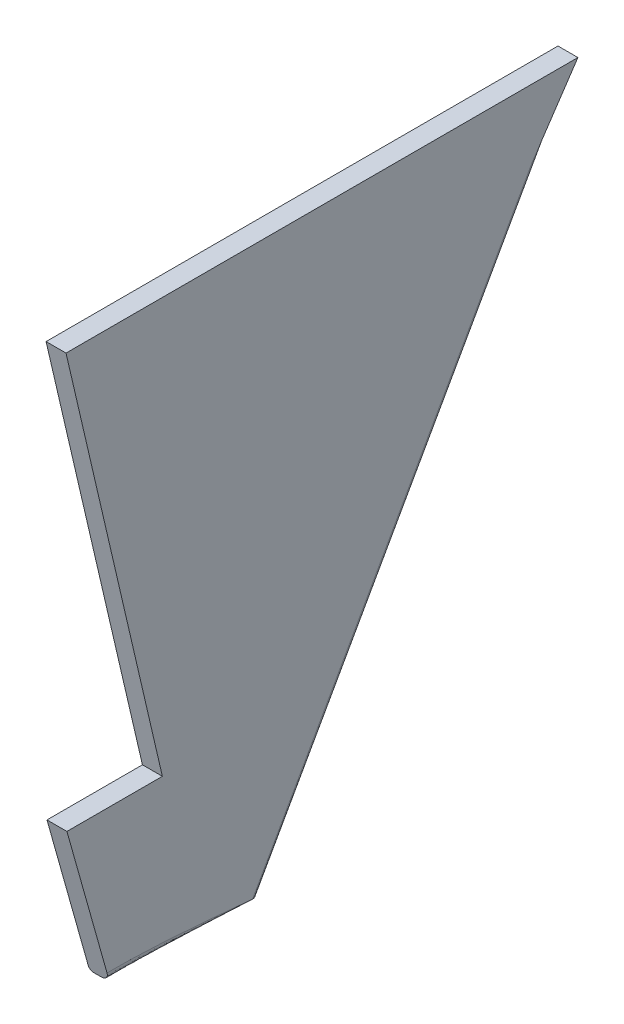
ISO-10303-21;
HEADER;
FILE_DESCRIPTION(('STEP AP214'),'2;1');
FILE_NAME('part.step','',(''),(''),'','','');
FILE_SCHEMA(('AUTOMOTIVE_DESIGN { 1 0 10303 214 1 1 1 1 }'));
ENDSEC;
DATA;
#1=APPLICATION_CONTEXT('core data for automotive mechanical design processes');
#2=APPLICATION_PROTOCOL_DEFINITION('international standard','automotive_design',2000,#1);
#3=PRODUCT_CONTEXT('',#1,'mechanical');
#4=PRODUCT('Part','Part','',(#3));
#5=PRODUCT_RELATED_PRODUCT_CATEGORY('part','',(#4));
#6=PRODUCT_DEFINITION_FORMATION('','',#4);
#7=PRODUCT_DEFINITION_CONTEXT('part definition',#1,'design');
#8=PRODUCT_DEFINITION('design','',#6,#7);
#9=PRODUCT_DEFINITION_SHAPE('','',#8);
#10=(LENGTH_UNIT() NAMED_UNIT(*) SI_UNIT(.MILLI.,.METRE.));
#11=(NAMED_UNIT(*) PLANE_ANGLE_UNIT() SI_UNIT($,.RADIAN.));
#12=(NAMED_UNIT(*) SI_UNIT($,.STERADIAN.) SOLID_ANGLE_UNIT());
#13=UNCERTAINTY_MEASURE_WITH_UNIT(LENGTH_MEASURE(1.E-05),#10,'distance_accuracy_value','');
#14=(GEOMETRIC_REPRESENTATION_CONTEXT(3) GLOBAL_UNCERTAINTY_ASSIGNED_CONTEXT((#13)) GLOBAL_UNIT_ASSIGNED_CONTEXT((#10,
#11,#12)) REPRESENTATION_CONTEXT('',''));
#15=CARTESIAN_POINT('',(0.,0.,0.));
#16=DIRECTION('',(0.,0.,1.));
#17=DIRECTION('',(1.,0.,0.));
#18=AXIS2_PLACEMENT_3D('',#15,#16,#17);
#19=CARTESIAN_POINT('',(11.43,199.641932542083,652.794975578985));
#20=DIRECTION('',(0.,0.48936367979796,0.872079806493993));
#21=DIRECTION('',(0.,-0.872079806493993,0.48936367979796));
#22=AXIS2_PLACEMENT_3D('',#19,#20,#21);
#23=PLANE('',#22);
#24=DIRECTION('',(-1.,0.,0.));
#25=VECTOR('',#24,1.);
#26=CARTESIAN_POINT('',(11.43,511.176192984029,477.978919826114));
#27=LINE('',#26,#25);
#28=CARTESIAN_POINT('',(8.89,511.176192984029,477.978919826114));
#29=VERTEX_POINT('',#28);
#30=CARTESIAN_POINT('',(0.,511.176192984029,477.978919826114));
#31=VERTEX_POINT('',#30);
#32=EDGE_CURVE('E132',#29,#31,#27,.T.);
#33=ORIENTED_EDGE('',*,*,#32,.F.);
#34=DIRECTION('',(0.,0.872079806493993,-0.48936367979796));
#35=VECTOR('',#34,1.);
#36=CARTESIAN_POINT('',(8.89,199.641932542083,652.794975578985));
#37=LINE('',#36,#35);
#38=CARTESIAN_POINT('',(8.89,199.641932542083,652.794975578985));
#39=VERTEX_POINT('',#38);
#40=EDGE_CURVE('E173',#29,#39,#37,.F.);
#41=ORIENTED_EDGE('',*,*,#40,.T.);
#42=DIRECTION('',(-1.,0.,0.));
#43=VECTOR('',#42,1.);
#44=CARTESIAN_POINT('',(11.43,199.641932542083,652.794975578985));
#45=LINE('',#44,#43);
#46=CARTESIAN_POINT('',(0.,199.641932542083,652.794975578985));
#47=VERTEX_POINT('',#46);
#48=EDGE_CURVE('E146',#39,#47,#45,.T.);
#49=ORIENTED_EDGE('',*,*,#48,.T.);
#50=DIRECTION('',(0.,0.872079806493993,-0.48936367979796));
#51=VECTOR('',#50,1.);
#52=CARTESIAN_POINT('',(0.,199.641932542083,652.794975578985));
#53=LINE('',#52,#51);
#54=EDGE_CURVE('E147',#47,#31,#53,.T.);
#55=ORIENTED_EDGE('',*,*,#54,.T.);
#56=EDGE_LOOP('',(#33,#41,#49,#55));
#57=FACE_BOUND('',#56,.T.);
#58=ADVANCED_FACE('F35',(#57),#23,.F.);
#59=CARTESIAN_POINT('',(11.43,524.187996290353,469.211556411961));
#60=DIRECTION('',(0.,0.558789444969546,0.829309565958712));
#61=DIRECTION('',(0.,-0.829309565958712,0.558789444969546));
#62=AXIS2_PLACEMENT_3D('',#59,#60,#61);
#63=PLANE('',#62);
#64=DIRECTION('',(0.,0.829309565958712,-0.558789444969546));
#65=VECTOR('',#64,1.);
#66=CARTESIAN_POINT('',(0.,524.187996290353,469.211556411961));
#67=LINE('',#66,#65);
#68=CARTESIAN_POINT('',(0.,524.187996290353,469.211556411961));
#69=VERTEX_POINT('',#68);
#70=EDGE_CURVE('E129',#31,#69,#67,.T.);
#71=ORIENTED_EDGE('',*,*,#70,.T.);
#72=DIRECTION('',(-1.,0.,0.));
#73=VECTOR('',#72,1.);
#74=CARTESIAN_POINT('',(11.43,524.187996290353,469.211556411961));
#75=LINE('',#74,#73);
#76=CARTESIAN_POINT('',(11.43,524.187996290353,469.211556411961));
#77=VERTEX_POINT('',#76);
#78=EDGE_CURVE('E126',#77,#69,#75,.T.);
#79=ORIENTED_EDGE('',*,*,#78,.F.);
#80=DIRECTION('',(0.,0.829309565958712,-0.558789444969546));
#81=VECTOR('',#80,1.);
#82=CARTESIAN_POINT('',(11.43,524.187996290353,469.211556411961));
#83=LINE('',#82,#81);
#84=CARTESIAN_POINT('',(11.43,485.322298720764,495.399294338459));
#85=VERTEX_POINT('',#84);
#86=EDGE_CURVE('E113',#85,#77,#83,.T.);
#87=ORIENTED_EDGE('',*,*,#86,.F.);
#88=CARTESIAN_POINT('',(8.89,485.322298720764,495.399294338459));
#89=DIRECTION('',(0.,0.558789444969546,0.829309565958712));
#90=DIRECTION('',(0.,0.829309565958712,-0.558789444969546));
#91=AXIS2_PLACEMENT_3D('',#88,#89,#90);
#92=ELLIPSE('',#91,31.1752032347239,2.54);
#93=EDGE_CURVE('E178',#85,#29,#92,.T.);
#94=ORIENTED_EDGE('',*,*,#93,.T.);
#95=ORIENTED_EDGE('',*,*,#32,.T.);
#96=EDGE_LOOP('',(#71,#79,#87,#94,#95));
#97=FACE_BOUND('',#96,.T.);
#98=ADVANCED_FACE('F127',(#97),#63,.F.);
#99=CARTESIAN_POINT('',(11.43,524.187996290353,762.632908821936));
#100=DIRECTION('',(0.,-1.,0.));
#101=DIRECTION('',(0.,0.,-1.));
#102=AXIS2_PLACEMENT_3D('',#99,#100,#101);
#103=PLANE('',#102);
#104=DIRECTION('',(0.,0.,1.));
#105=VECTOR('',#104,1.);
#106=CARTESIAN_POINT('',(0.,524.187996290353,762.632908821936));
#107=LINE('',#106,#105);
#108=CARTESIAN_POINT('',(0.,524.187996290353,762.632908821936));
#109=VERTEX_POINT('',#108);
#110=EDGE_CURVE('E151',#69,#109,#107,.T.);
#111=ORIENTED_EDGE('',*,*,#110,.T.);
#112=DIRECTION('',(-1.,0.,0.));
#113=VECTOR('',#112,1.);
#114=CARTESIAN_POINT('',(11.43,524.187996290353,762.632908821936));
#115=LINE('',#114,#113);
#116=CARTESIAN_POINT('',(11.43,524.187996290353,762.632908821936));
#117=VERTEX_POINT('',#116);
#118=EDGE_CURVE('E133',#117,#109,#115,.T.);
#119=ORIENTED_EDGE('',*,*,#118,.F.);
#120=DIRECTION('',(0.,0.,1.));
#121=VECTOR('',#120,1.);
#122=CARTESIAN_POINT('',(11.43,524.187996290353,762.632908821936));
#123=LINE('',#122,#121);
#124=EDGE_CURVE('E117',#77,#117,#123,.T.);
#125=ORIENTED_EDGE('',*,*,#124,.F.);
#126=ORIENTED_EDGE('',*,*,#78,.T.);
#127=EDGE_LOOP('',(#111,#119,#125,#126));
#128=FACE_BOUND('',#127,.T.);
#129=ADVANCED_FACE('F135',(#128),#103,.F.);
#130=CARTESIAN_POINT('',(11.43,286.46929318948,707.407516880236));
#131=DIRECTION('',(0.,0.226287918956308,-0.974060458972863));
#132=DIRECTION('',(0.,0.974060458972863,0.226287918956308));
#133=AXIS2_PLACEMENT_3D('',#130,#131,#132);
#134=PLANE('',#133);
#135=DIRECTION('',(0.,-0.974060458972862,-0.226287918956308));
#136=VECTOR('',#135,1.);
#137=CARTESIAN_POINT('',(0.,286.46929318948,707.407516880236));
#138=LINE('',#137,#136);
#139=CARTESIAN_POINT('',(0.,286.46929318948,707.407516880236));
#140=VERTEX_POINT('',#139);
#141=EDGE_CURVE('E153',#109,#140,#138,.T.);
#142=ORIENTED_EDGE('',*,*,#141,.T.);
#143=DIRECTION('',(-1.,0.,0.));
#144=VECTOR('',#143,1.);
#145=CARTESIAN_POINT('',(11.43,286.46929318948,707.407516880236));
#146=LINE('',#145,#144);
#147=CARTESIAN_POINT('',(11.43,286.46929318948,707.407516880236));
#148=VERTEX_POINT('',#147);
#149=EDGE_CURVE('E167',#148,#140,#146,.T.);
#150=ORIENTED_EDGE('',*,*,#149,.F.);
#151=DIRECTION('',(0.,-0.974060458972862,-0.226287918956308));
#152=VECTOR('',#151,1.);
#153=CARTESIAN_POINT('',(11.43,286.46929318948,707.407516880236));
#154=LINE('',#153,#152);
#155=EDGE_CURVE('E138',#117,#148,#154,.T.);
#156=ORIENTED_EDGE('',*,*,#155,.F.);
#157=ORIENTED_EDGE('',*,*,#118,.T.);
#158=EDGE_LOOP('',(#142,#150,#156,#157));
#159=FACE_BOUND('',#158,.T.);
#160=ADVANCED_FACE('F221',(#159),#134,.F.);
#161=CARTESIAN_POINT('',(11.43,286.46929318948,762.117456695006));
#162=DIRECTION('',(0.,-1.,0.));
#163=DIRECTION('',(0.,0.,-1.));
#164=AXIS2_PLACEMENT_3D('',#161,#162,#163);
#165=PLANE('',#164);
#166=DIRECTION('',(0.,0.,1.));
#167=VECTOR('',#166,1.);
#168=CARTESIAN_POINT('',(0.,286.46929318948,762.117456695006));
#169=LINE('',#168,#167);
#170=CARTESIAN_POINT('',(0.,286.46929318948,762.117456695006));
#171=VERTEX_POINT('',#170);
#172=EDGE_CURVE('E155',#140,#171,#169,.T.);
#173=ORIENTED_EDGE('',*,*,#172,.T.);
#174=DIRECTION('',(-1.,0.,0.));
#175=VECTOR('',#174,1.);
#176=CARTESIAN_POINT('',(11.43,286.46929318948,762.117456695006));
#177=LINE('',#176,#175);
#178=CARTESIAN_POINT('',(11.43,286.46929318948,762.117456695006));
#179=VERTEX_POINT('',#178);
#180=EDGE_CURVE('E164',#179,#171,#177,.T.);
#181=ORIENTED_EDGE('',*,*,#180,.F.);
#182=DIRECTION('',(0.,0.,1.));
#183=VECTOR('',#182,1.);
#184=CARTESIAN_POINT('',(11.43,286.46929318948,762.117456695006));
#185=LINE('',#184,#183);
#186=EDGE_CURVE('E140',#148,#179,#185,.T.);
#187=ORIENTED_EDGE('',*,*,#186,.F.);
#188=ORIENTED_EDGE('',*,*,#149,.T.);
#189=EDGE_LOOP('',(#173,#181,#187,#188));
#190=FACE_BOUND('',#189,.T.);
#191=ADVANCED_FACE('F216',(#190),#165,.F.);
#192=CARTESIAN_POINT('',(11.43,232.379623890235,746.905427948856));
#193=DIRECTION('',(0.,0.270734184612174,-0.96265414416725));
#194=DIRECTION('',(0.,0.96265414416725,0.270734184612174));
#195=AXIS2_PLACEMENT_3D('',#192,#193,#194);
#196=PLANE('',#195);
#197=DIRECTION('',(0.,-0.962654144167251,-0.270734184612174));
#198=VECTOR('',#197,1.);
#199=CARTESIAN_POINT('',(0.,232.379623890235,746.905427948856));
#200=LINE('',#199,#198);
#201=CARTESIAN_POINT('',(0.,202.181932542083,738.412712892417));
#202=VERTEX_POINT('',#201);
#203=EDGE_CURVE('E123',#171,#202,#200,.T.);
#204=ORIENTED_EDGE('',*,*,#203,.T.);
#205=CARTESIAN_POINT('',(0.,202.181932542083,738.412712892417));
#206=CARTESIAN_POINT('',(-3.71423070567647E-05,202.060029204381,738.378429135437));
#207=CARTESIAN_POINT('',(0.00877578466586887,201.938158327907,738.344154507764));
#208=CARTESIAN_POINT('',(0.043820666096106,201.696588485174,738.276216074427));
#209=CARTESIAN_POINT('',(0.070076692611092,201.576892755537,738.242553179024));
#210=CARTESIAN_POINT('',(0.147116432041593,201.317216131818,738.169522444766));
#211=CARTESIAN_POINT('',(0.201923267217242,201.178321912361,738.130460219272));
#212=CARTESIAN_POINT('',(0.335424452017582,200.911623591818,738.055454722451));
#213=CARTESIAN_POINT('',(0.414117460006704,200.783818868376,738.019511276095));
#214=CARTESIAN_POINT('',(0.591738151979026,200.545617825331,737.95252027465));
#215=CARTESIAN_POINT('',(0.690254214640734,200.434937557279,737.921392862687));
#216=CARTESIAN_POINT('',(0.905841754247257,200.231791783485,737.864260708051));
#217=CARTESIAN_POINT('',(1.02291101226961,200.139324102518,737.838255353624));
#218=CARTESIAN_POINT('',(1.26783850658103,199.978777362665,737.793103633279));
#219=CARTESIAN_POINT('',(1.39516894535962,199.90995160825,737.773747268779));
#220=CARTESIAN_POINT('',(1.66032111187818,199.7947548026,737.741349638294));
#221=CARTESIAN_POINT('',(1.79813481157029,199.748366765033,737.72830359512));
#222=CARTESIAN_POINT('',(2.03719877108296,199.690142938727,737.71192888751));
#223=CARTESIAN_POINT('',(2.13686370018449,199.672095082155,737.706853158327));
#224=CARTESIAN_POINT('',(2.33766838252238,199.647980894492,737.700071350993));
#225=CARTESIAN_POINT('',(2.43880698021651,199.641905636269,737.698362762202));
#226=CARTESIAN_POINT('',(2.54,199.641932542083,737.698370329118));
#227=B_SPLINE_CURVE_WITH_KNOTS('',3,(#205,#206,#207,#208,#209,#210,#211,#212,#213,#214,#215,
#216,#217,#218,#219,#220,#221,#222,#223,#224,#225,#226),.UNSPECIFIED.,.F.,.F.,(4,2,2,2,2,2,2,2,
2,2,4),(0.,0.379526777651838,0.759578405906741,1.22029475564002,1.68098523270193,
2.13294730481857,2.58485536397386,3.02078575347061,3.45638560608309,3.75989194789427,
4.06317190046572),.UNSPECIFIED.);
#228=CARTESIAN_POINT('',(2.54,199.641932542083,737.698370329118));
#229=VERTEX_POINT('',#228);
#230=EDGE_CURVE('E49',#202,#229,#227,.T.);
#231=ORIENTED_EDGE('',*,*,#230,.T.);
#232=DIRECTION('',(-1.,0.,0.));
#233=VECTOR('',#232,1.);
#234=CARTESIAN_POINT('',(11.43,199.641932542083,737.698370329118));
#235=LINE('',#234,#233);
#236=CARTESIAN_POINT('',(6.35,199.641932542083,737.698370329118));
#237=VERTEX_POINT('',#236);
#238=EDGE_CURVE('E161',#237,#229,#235,.T.);
#239=ORIENTED_EDGE('',*,*,#238,.F.);
#240=CARTESIAN_POINT('',(6.35,199.641932542083,737.698370329118));
#241=CARTESIAN_POINT('',(6.47639145489411,199.641920325993,737.698366893499));
#242=CARTESIAN_POINT('',(6.6027799922629,199.646649017691,737.699696777652));
#243=CARTESIAN_POINT('',(6.85478052801889,199.665498439716,737.704997936883));
#244=CARTESIAN_POINT('',(6.98039263924903,199.67961777123,737.708968818562));
#245=CARTESIAN_POINT('',(7.22999777995247,199.717142218441,737.71952209014));
#246=CARTESIAN_POINT('',(7.35399213759053,199.740539147406,737.726102177624));
#247=CARTESIAN_POINT('',(7.59974899756786,199.796446968304,737.741825538289));
#248=CARTESIAN_POINT('',(7.7215113419571,199.828958502606,737.750968992128));
#249=CARTESIAN_POINT('',(7.97310016590999,199.906248898981,737.772705929082));
#250=CARTESIAN_POINT('',(8.10264571976629,199.951877746433,737.785538459732));
#251=CARTESIAN_POINT('',(8.35739517504228,200.053359658154,737.814078951443));
#252=CARTESIAN_POINT('',(8.48259733715944,200.109216763354,737.829788048965));
#253=CARTESIAN_POINT('',(8.72776454988735,200.230680194199,737.86394808776));
#254=CARTESIAN_POINT('',(8.84773038891337,200.296285045562,737.882398614408));
#255=CARTESIAN_POINT('',(9.08171958515183,200.436756141172,737.921904316183));
#256=CARTESIAN_POINT('',(9.19574068780711,200.51162586335,737.942960469432));
#257=CARTESIAN_POINT('',(9.41922983802213,200.671565483515,737.987941445118));
#258=CARTESIAN_POINT('',(9.52856713690979,200.756804685328,738.011913882093));
#259=CARTESIAN_POINT('',(9.73964499332591,200.935661208016,738.062214995038));
#260=CARTESIAN_POINT('',(9.84138274222777,201.029281598566,738.088544534315));
#261=CARTESIAN_POINT('',(10.0365884577976,201.224150296091,738.143348866951));
#262=CARTESIAN_POINT('',(10.1300584293888,201.325396742672,738.171823137099));
#263=CARTESIAN_POINT('',(10.3082545926106,201.534843839964,738.230727458499));
#264=CARTESIAN_POINT('',(10.392977502186,201.643047076454,738.261158236968));
#265=CARTESIAN_POINT('',(10.5559193459683,201.869433455655,738.324826515083));
#266=CARTESIAN_POINT('',(10.6338163163471,201.987831442868,738.358124437003));
#267=CARTESIAN_POINT('',(10.7793035415336,202.230410008832,738.426346560866));
#268=CARTESIAN_POINT('',(10.8468898723035,202.354592765806,738.461271375407));
#269=CARTESIAN_POINT('',(10.9713417248433,202.607815797695,738.532487119378));
#270=CARTESIAN_POINT('',(11.028209555627,202.736855019212,738.568777752553));
#271=CARTESIAN_POINT('',(11.1309544897785,202.998935688407,738.642484593901));
#272=CARTESIAN_POINT('',(11.1768279420773,203.131978449136,738.679901171353));
#273=CARTESIAN_POINT('',(11.2877049266575,203.502859787035,738.784206811351));
#274=CARTESIAN_POINT('',(11.3410504240505,203.744073022218,738.852044953367));
#275=CARTESIAN_POINT('',(11.3944047351492,204.10911080614,738.954707168433));
#276=CARTESIAN_POINT('',(11.4077455120187,204.231299870533,738.989071282396));
#277=CARTESIAN_POINT('',(11.4255408311109,204.476285454165,739.05797034924));
#278=CARTESIAN_POINT('',(11.4299947244364,204.599082017106,739.092505314411));
#279=CARTESIAN_POINT('',(11.43,204.721932542083,739.127055455716));
#280=B_SPLINE_CURVE_WITH_KNOTS('',3,(#240,#241,#242,#243,#244,#245,#246,#247,#248,#249,#250,
#251,#252,#253,#254,#255,#256,#257,#258,#259,#260,#261,#262,#263,#264,#265,#266,#267,#268,#269,
#270,#271,#272,#273,#274,#275,#276,#277,#278,#279),.UNSPECIFIED.,.F.,.F.,(4,2,2,2,2,2,2,2,2,2,2,
2,2,2,2,2,2,2,2,4),(0.,0.379074405728894,0.758092357797334,1.13677659869314,1.51548753479688,
1.92883371595138,2.34234355367139,2.75579091432969,3.16939395212791,3.59099813216493,
4.01275736472699,4.43441403931725,4.85622835644198,5.29248355516594,5.72890437252449,
6.16523106698195,6.60170245887647,7.36729354391113,7.74992519265412,8.13258477913859),.UNSPECIFIED.);
#281=CARTESIAN_POINT('',(11.43,204.721932542083,739.127055455716));
#282=VERTEX_POINT('',#281);
#283=EDGE_CURVE('E56',#237,#282,#280,.T.);
#284=ORIENTED_EDGE('',*,*,#283,.T.);
#285=DIRECTION('',(0.,-0.962654144167251,-0.270734184612173));
#286=VECTOR('',#285,1.);
#287=CARTESIAN_POINT('',(11.43,232.379623890235,746.905427948856));
#288=LINE('',#287,#286);
#289=EDGE_CURVE('E144',#179,#282,#288,.T.);
#290=ORIENTED_EDGE('',*,*,#289,.F.);
#291=ORIENTED_EDGE('',*,*,#180,.T.);
#292=EDGE_LOOP('',(#204,#231,#239,#284,#290,#291));
#293=FACE_BOUND('',#292,.T.);
#294=ADVANCED_FACE('F210',(#293),#196,.F.);
#295=CARTESIAN_POINT('',(11.43,199.641932542083,737.698370329118));
#296=DIRECTION('',(0.,1.,0.));
#297=DIRECTION('',(0.,0.,1.));
#298=AXIS2_PLACEMENT_3D('',#295,#296,#297);
#299=PLANE('',#298);
#300=ORIENTED_EDGE('',*,*,#238,.T.);
#301=CARTESIAN_POINT('',(2.54,199.641932542083,909.648187519282));
#302=CARTESIAN_POINT('',(2.54,199.641932542083,852.331581789227));
#303=CARTESIAN_POINT('',(2.54,199.641932542083,795.014976059173));
#304=CARTESIAN_POINT('',(2.54,199.641932542083,737.698370329118));
#305=CARTESIAN_POINT('',(2.54,199.641932542083,709.39723874574));
#306=CARTESIAN_POINT('',(1.27,199.641932542083,681.096107162363));
#307=CARTESIAN_POINT('',(0.,199.641932542083,652.794975578985));
#308=(BOUNDED_CURVE() B_SPLINE_CURVE(3,(#301,#302,#303,#304,#305,#306,#307),.UNSPECIFIED.,.F.,
.F.) B_SPLINE_CURVE_WITH_KNOTS((4,3,4),(-0.171949817190164,0.,0.0849033947501334),
.UNSPECIFIED.) CURVE() GEOMETRIC_REPRESENTATION_ITEM() RATIONAL_B_SPLINE_CURVE((1.,1.,1.,1.,1.,
1.,1.)) REPRESENTATION_ITEM(''));
#309=EDGE_CURVE('E184',#229,#47,#308,.T.);
#310=ORIENTED_EDGE('',*,*,#309,.T.);
#311=ORIENTED_EDGE('',*,*,#48,.F.);
#312=CARTESIAN_POINT('',(8.89,199.641932542083,655.707553053071));
#313=DIRECTION('',(0.,1.,0.));
#314=DIRECTION('',(0.,0.,-1.));
#315=AXIS2_PLACEMENT_3D('',#312,#313,#314);
#316=ELLIPSE('',#315,2.91257747408637,2.54);
#317=CARTESIAN_POINT('',(11.43,199.641932542083,655.707553053071));
#318=VERTEX_POINT('',#317);
#319=EDGE_CURVE('E175',#39,#318,#316,.F.);
#320=ORIENTED_EDGE('',*,*,#319,.T.);
#321=CARTESIAN_POINT('',(6.35,199.641932542083,905.966060261007));
#322=CARTESIAN_POINT('',(6.35,199.641932542083,849.876830283711));
#323=CARTESIAN_POINT('',(6.35,199.641932542083,793.787600306414));
#324=CARTESIAN_POINT('',(6.35,199.641932542083,737.698370329118));
#325=CARTESIAN_POINT('',(6.35,199.641932542083,710.368097903769));
#326=CARTESIAN_POINT('',(8.89,199.641932542083,683.03782547842));
#327=CARTESIAN_POINT('',(11.43,199.641932542083,655.707553053071));
#328=(BOUNDED_CURVE() B_SPLINE_CURVE(3,(#321,#322,#323,#324,#325,#326,#327),.UNSPECIFIED.,.F.,
.F.) B_SPLINE_CURVE_WITH_KNOTS((4,3,4),(-0.168267689931889,0.,0.081990817276047),
.UNSPECIFIED.) CURVE() GEOMETRIC_REPRESENTATION_ITEM() RATIONAL_B_SPLINE_CURVE((1.,1.,1.,1.,1.,
1.,1.)) REPRESENTATION_ITEM(''));
#329=EDGE_CURVE('E180',#318,#237,#328,.F.);
#330=ORIENTED_EDGE('',*,*,#329,.T.);
#331=EDGE_LOOP('',(#300,#310,#311,#320,#330));
#332=FACE_BOUND('',#331,.T.);
#333=ADVANCED_FACE('F215',(#332),#299,.F.);
#334=CARTESIAN_POINT('',(11.43,0.,0.));
#335=DIRECTION('',(-1.,0.,0.));
#336=DIRECTION('',(0.,0.,1.));
#337=AXIS2_PLACEMENT_3D('',#334,#335,#336);
#338=PLANE('',#337);
#339=ORIENTED_EDGE('',*,*,#289,.T.);
#340=CARTESIAN_POINT('',(11.43,204.721932542083,905.966060261007));
#341=CARTESIAN_POINT('',(11.43,204.721932542083,849.876830283711));
#342=CARTESIAN_POINT('',(11.43,204.721932542083,793.787600306414));
#343=CARTESIAN_POINT('',(11.43,204.721932542083,737.698370329118));
#344=CARTESIAN_POINT('',(11.43,204.721932542083,710.368097903769));
#345=CARTESIAN_POINT('',(11.43,202.181932542083,683.03782547842));
#346=CARTESIAN_POINT('',(11.43,199.641932542083,655.707553053071));
#347=(BOUNDED_CURVE() B_SPLINE_CURVE(3,(#340,#341,#342,#343,#344,#345,#346),.UNSPECIFIED.,.F.,
.F.) B_SPLINE_CURVE_WITH_KNOTS((4,3,4),(-0.168267689931889,0.,0.081990817276047),
.UNSPECIFIED.) CURVE() GEOMETRIC_REPRESENTATION_ITEM() RATIONAL_B_SPLINE_CURVE((1.,1.,1.,1.,1.,
1.,1.)) REPRESENTATION_ITEM(''));
#348=EDGE_CURVE('E11',#282,#318,#347,.T.);
#349=ORIENTED_EDGE('',*,*,#348,.T.);
#350=DIRECTION('',(0.,0.872079806493993,-0.48936367979796));
#351=VECTOR('',#350,1.);
#352=CARTESIAN_POINT('',(11.43,327.642111653973,583.880825500673));
#353=LINE('',#352,#351);
#354=EDGE_CURVE('E120',#318,#85,#353,.T.);
#355=ORIENTED_EDGE('',*,*,#354,.T.);
#356=ORIENTED_EDGE('',*,*,#86,.T.);
#357=ORIENTED_EDGE('',*,*,#124,.T.);
#358=ORIENTED_EDGE('',*,*,#155,.T.);
#359=ORIENTED_EDGE('',*,*,#186,.T.);
#360=EDGE_LOOP('',(#339,#349,#355,#356,#357,#358,#359));
#361=FACE_BOUND('',#360,.T.);
#362=ADVANCED_FACE('F115',(#361),#338,.F.);
#363=CARTESIAN_POINT('',(0.,0.,0.));
#364=DIRECTION('',(-1.,0.,0.));
#365=DIRECTION('',(0.,0.,1.));
#366=AXIS2_PLACEMENT_3D('',#363,#364,#365);
#367=PLANE('',#366);
#368=ORIENTED_EDGE('',*,*,#54,.F.);
#369=CARTESIAN_POINT('',(0.,202.181932542083,909.648187519282));
#370=CARTESIAN_POINT('',(0.,202.181932542083,852.331581789227));
#371=CARTESIAN_POINT('',(0.,202.181932542083,795.014976059173));
#372=CARTESIAN_POINT('',(0.,202.181932542083,737.698370329118));
#373=CARTESIAN_POINT('',(0.,202.181932542083,709.39723874574));
#374=CARTESIAN_POINT('',(0.,200.911932542083,681.096107162363));
#375=CARTESIAN_POINT('',(0.,199.641932542083,652.794975578985));
#376=(BOUNDED_CURVE() B_SPLINE_CURVE(3,(#369,#370,#371,#372,#373,#374,#375),.UNSPECIFIED.,.F.,
.F.) B_SPLINE_CURVE_WITH_KNOTS((4,3,4),(-0.171949817190164,0.,0.0849033947501334),
.UNSPECIFIED.) CURVE() GEOMETRIC_REPRESENTATION_ITEM() RATIONAL_B_SPLINE_CURVE((1.,1.,1.,1.,1.,
1.,1.)) REPRESENTATION_ITEM(''));
#377=EDGE_CURVE('E64',#47,#202,#376,.F.);
#378=ORIENTED_EDGE('',*,*,#377,.T.);
#379=ORIENTED_EDGE('',*,*,#203,.F.);
#380=ORIENTED_EDGE('',*,*,#172,.F.);
#381=ORIENTED_EDGE('',*,*,#141,.F.);
#382=ORIENTED_EDGE('',*,*,#110,.F.);
#383=ORIENTED_EDGE('',*,*,#70,.F.);
#384=EDGE_LOOP('',(#368,#378,#379,#380,#381,#382,#383));
#385=FACE_BOUND('',#384,.T.);
#386=ADVANCED_FACE('F236',(#385),#367,.T.);
#387=CARTESIAN_POINT('',(8.89,327.642111653973,583.880825500673));
#388=DIRECTION('',(0.,0.872079806493993,-0.48936367979796));
#389=DIRECTION('',(0.,0.48936367979796,0.872079806493993));
#390=AXIS2_PLACEMENT_3D('',#387,#388,#389);
#391=CYLINDRICAL_SURFACE('',#390,2.54);
#392=ORIENTED_EDGE('',*,*,#319,.F.);
#393=ORIENTED_EDGE('',*,*,#40,.F.);
#394=ORIENTED_EDGE('',*,*,#93,.F.);
#395=ORIENTED_EDGE('',*,*,#354,.F.);
#396=EDGE_LOOP('',(#392,#393,#394,#395));
#397=FACE_BOUND('',#396,.T.);
#398=ADVANCED_FACE('F233',(#397),#391,.T.);
#399=CARTESIAN_POINT('',(2.54,199.641932542083,756.152708063761));
#400=CARTESIAN_POINT('',(2.54,199.641932542083,750.001262152213));
#401=CARTESIAN_POINT('',(2.54,199.641932542083,743.849816240666));
#402=CARTESIAN_POINT('',(2.54,199.641932542083,737.698370329118));
#403=CARTESIAN_POINT('',(2.54,199.641932542083,709.39723874574));
#404=CARTESIAN_POINT('',(1.27,199.641932542083,681.096107162363));
#405=CARTESIAN_POINT('',(0.,199.641932542083,652.794975578985));
#406=CARTESIAN_POINT('',(0.,199.641932542083,756.152708063761));
#407=CARTESIAN_POINT('',(0.,199.641932542083,750.001262152213));
#408=CARTESIAN_POINT('',(0.,199.641932542083,743.849816240666));
#409=CARTESIAN_POINT('',(0.,199.641932542083,737.698370329118));
#410=CARTESIAN_POINT('',(0.,199.641932542083,709.39723874574));
#411=CARTESIAN_POINT('',(0.,199.641932542083,681.096107162363));
#412=CARTESIAN_POINT('',(0.,199.641932542083,652.794975578985));
#413=CARTESIAN_POINT('',(0.,202.181932542083,756.152708063761));
#414=CARTESIAN_POINT('',(0.,202.181932542083,750.001262152213));
#415=CARTESIAN_POINT('',(0.,202.181932542083,743.849816240666));
#416=CARTESIAN_POINT('',(0.,202.181932542083,737.698370329118));
#417=CARTESIAN_POINT('',(0.,202.181932542083,709.39723874574));
#418=CARTESIAN_POINT('',(0.,200.911932542083,681.096107162363));
#419=CARTESIAN_POINT('',(0.,199.641932542083,652.794975578985));
#420=(BOUNDED_SURFACE() B_SPLINE_SURFACE(2,3,((#399,#400,#401,#402,#403,#404,#405),(#406,#407,
#408,#409,#410,#411,#412),(#413,#414,#415,#416,#417,#418,#419)),.UNSPECIFIED.,.F.,.F.,
.F.) B_SPLINE_SURFACE_WITH_KNOTS((3,3),(4,3,4),(0.,1.),(-0.0184543377346424,0.,
0.0849033947501334),
.UNSPECIFIED.) GEOMETRIC_REPRESENTATION_ITEM() RATIONAL_B_SPLINE_SURFACE(((1.,1.,1.,1.,1.,1.,
1.),(0.707106781186548,0.707106781186548,0.707106781186548,0.707106781186548,0.707106781186548,
0.707106781186548,0.707106781186548),(1.,1.,1.,1.,1.,1.,1.))) REPRESENTATION_ITEM('') SURFACE());
#421=ORIENTED_EDGE('',*,*,#230,.F.);
#422=ORIENTED_EDGE('',*,*,#377,.F.);
#423=ORIENTED_EDGE('',*,*,#309,.F.);
#424=EDGE_LOOP('',(#421,#422,#423));
#425=FACE_BOUND('',#424,.T.);
#426=ADVANCED_FACE('F235',(#425),#420,.T.);
#427=CARTESIAN_POINT('',(11.43,204.721932542083,756.411576353545));
#428=CARTESIAN_POINT('',(11.43,204.721932542083,750.173841012069));
#429=CARTESIAN_POINT('',(11.43,204.721932542083,743.936105670594));
#430=CARTESIAN_POINT('',(11.43,204.721932542083,737.698370329118));
#431=CARTESIAN_POINT('',(11.43,204.721932542083,710.368097903769));
#432=CARTESIAN_POINT('',(11.43,202.181932542083,683.03782547842));
#433=CARTESIAN_POINT('',(11.43,199.641932542083,655.707553053071));
#434=CARTESIAN_POINT('',(11.43,199.641932542083,756.411576353545));
#435=CARTESIAN_POINT('',(11.43,199.641932542083,750.173841012069));
#436=CARTESIAN_POINT('',(11.43,199.641932542083,743.936105670594));
#437=CARTESIAN_POINT('',(11.43,199.641932542083,737.698370329118));
#438=CARTESIAN_POINT('',(11.43,199.641932542083,710.368097903769));
#439=CARTESIAN_POINT('',(11.43,199.641932542083,683.03782547842));
#440=CARTESIAN_POINT('',(11.43,199.641932542083,655.707553053071));
#441=CARTESIAN_POINT('',(6.35,199.641932542083,756.411576353545));
#442=CARTESIAN_POINT('',(6.35,199.641932542083,750.173841012069));
#443=CARTESIAN_POINT('',(6.35,199.641932542083,743.936105670594));
#444=CARTESIAN_POINT('',(6.35,199.641932542083,737.698370329118));
#445=CARTESIAN_POINT('',(6.35,199.641932542083,710.368097903769));
#446=CARTESIAN_POINT('',(8.89,199.641932542083,683.03782547842));
#447=CARTESIAN_POINT('',(11.43,199.641932542083,655.707553053071));
#448=(BOUNDED_SURFACE() B_SPLINE_SURFACE(2,3,((#427,#428,#429,#430,#431,#432,#433),(#434,#435,
#436,#437,#438,#439,#440),(#441,#442,#443,#444,#445,#446,#447)),.UNSPECIFIED.,.F.,.F.,
.F.) B_SPLINE_SURFACE_WITH_KNOTS((3,3),(4,3,4),(0.,1.),(-0.0187132060244265,0.,
0.081990817276047),
.UNSPECIFIED.) GEOMETRIC_REPRESENTATION_ITEM() RATIONAL_B_SPLINE_SURFACE(((1.,1.,1.,1.,1.,1.,
1.),(0.707106781186548,0.707106781186548,0.707106781186548,0.707106781186548,0.707106781186548,
0.707106781186548,0.707106781186548),(1.,1.,1.,1.,1.,1.,1.))) REPRESENTATION_ITEM('') SURFACE());
#449=ORIENTED_EDGE('',*,*,#283,.F.);
#450=ORIENTED_EDGE('',*,*,#329,.F.);
#451=ORIENTED_EDGE('',*,*,#348,.F.);
#452=EDGE_LOOP('',(#449,#450,#451));
#453=FACE_BOUND('',#452,.T.);
#454=ADVANCED_FACE('F38',(#453),#448,.T.);
#455=CLOSED_SHELL('',(#58,#98,#129,#160,#191,#294,#333,#362,#386,#398,#426,#454));
#456=MANIFOLD_SOLID_BREP('B2',#455);
#457=ADVANCED_BREP_SHAPE_REPRESENTATION('',(#18,#456),#14);
#458=SHAPE_DEFINITION_REPRESENTATION(#9,#457);
ENDSEC;
END-ISO-10303-21;
